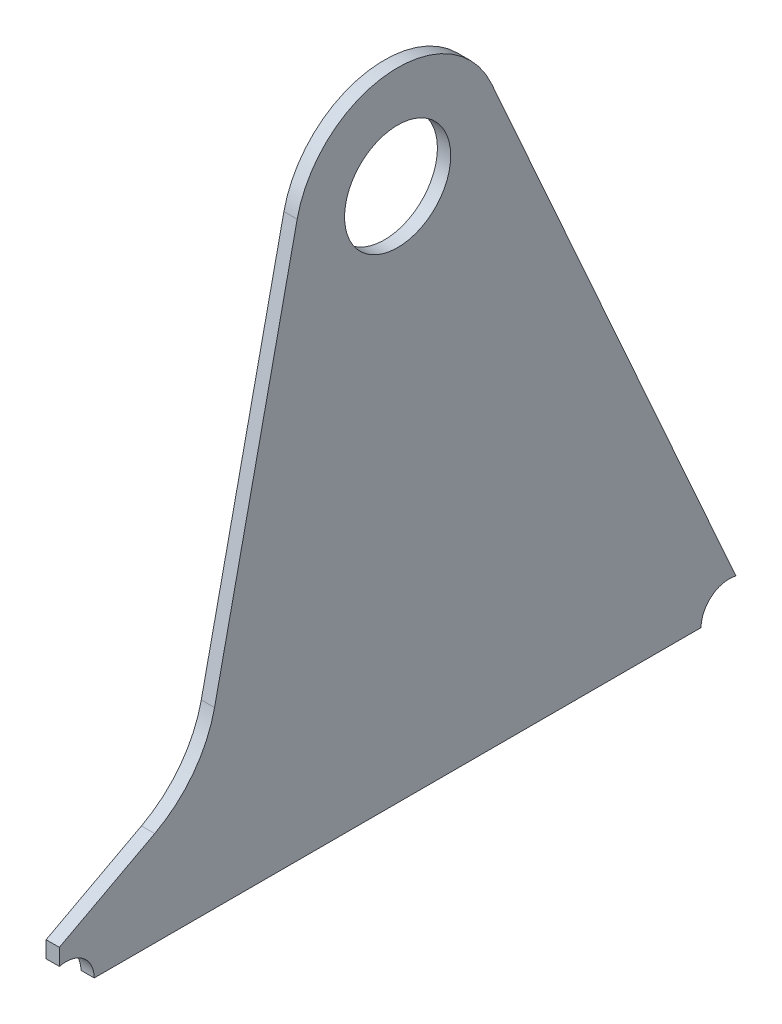
ISO-10303-21;
HEADER;
FILE_DESCRIPTION(('STEP AP214'),'2;1');
FILE_NAME('part.step','',(''),(''),'','','');
FILE_SCHEMA(('AUTOMOTIVE_DESIGN { 1 0 10303 214 1 1 1 1 }'));
ENDSEC;
DATA;
#1=APPLICATION_CONTEXT('core data for automotive mechanical design processes');
#2=APPLICATION_PROTOCOL_DEFINITION('international standard','automotive_design',2000,#1);
#3=PRODUCT_CONTEXT('',#1,'mechanical');
#4=PRODUCT('Part','Part','',(#3));
#5=PRODUCT_RELATED_PRODUCT_CATEGORY('part','',(#4));
#6=PRODUCT_DEFINITION_FORMATION('','',#4);
#7=PRODUCT_DEFINITION_CONTEXT('part definition',#1,'design');
#8=PRODUCT_DEFINITION('design','',#6,#7);
#9=PRODUCT_DEFINITION_SHAPE('','',#8);
#10=(LENGTH_UNIT() NAMED_UNIT(*) SI_UNIT(.MILLI.,.METRE.));
#11=(NAMED_UNIT(*) PLANE_ANGLE_UNIT() SI_UNIT($,.RADIAN.));
#12=(NAMED_UNIT(*) SI_UNIT($,.STERADIAN.) SOLID_ANGLE_UNIT());
#13=UNCERTAINTY_MEASURE_WITH_UNIT(LENGTH_MEASURE(1.E-05),#10,'distance_accuracy_value','');
#14=(GEOMETRIC_REPRESENTATION_CONTEXT(3) GLOBAL_UNCERTAINTY_ASSIGNED_CONTEXT((#13)) GLOBAL_UNIT_ASSIGNED_CONTEXT((#10,
#11,#12)) REPRESENTATION_CONTEXT('',''));
#15=CARTESIAN_POINT('',(0.,0.,0.));
#16=DIRECTION('',(0.,0.,1.));
#17=DIRECTION('',(1.,0.,0.));
#18=AXIS2_PLACEMENT_3D('',#15,#16,#17);
#19=CARTESIAN_POINT('',(-2.,0.,0.));
#20=DIRECTION('',(1.,0.,0.));
#21=DIRECTION('',(0.,0.,-1.));
#22=AXIS2_PLACEMENT_3D('',#19,#20,#21);
#23=CYLINDRICAL_SURFACE('',#22,31.);
#24=DIRECTION('',(1.,0.,0.));
#25=VECTOR('',#24,1.);
#26=CARTESIAN_POINT('',(-2.,6.55896973025909,30.2981833791656));
#27=LINE('',#26,#25);
#28=CARTESIAN_POINT('',(-2.,6.55896973025909,30.2981833791656));
#29=VERTEX_POINT('',#28);
#30=CARTESIAN_POINT('',(2.,6.55896973025909,30.2981833791656));
#31=VERTEX_POINT('',#30);
#32=EDGE_CURVE('E37',#29,#31,#27,.T.);
#33=ORIENTED_EDGE('',*,*,#32,.T.);
#34=CARTESIAN_POINT('',(2.,0.,0.));
#35=DIRECTION('',(1.,0.,0.));
#36=DIRECTION('',(0.,0.,1.));
#37=AXIS2_PLACEMENT_3D('',#34,#35,#36);
#38=CIRCLE('',#37,31.);
#39=CARTESIAN_POINT('',(2.,12.6177889557744,-28.3159213494376));
#40=VERTEX_POINT('',#39);
#41=EDGE_CURVE('E104',#40,#31,#38,.T.);
#42=ORIENTED_EDGE('',*,*,#41,.F.);
#43=DIRECTION('',(1.,0.,0.));
#44=VECTOR('',#43,1.);
#45=CARTESIAN_POINT('',(-2.,12.6177889557744,-28.3159213494376));
#46=LINE('',#45,#44);
#47=CARTESIAN_POINT('',(-2.,12.6177889557744,-28.3159213494376));
#48=VERTEX_POINT('',#47);
#49=EDGE_CURVE('E11',#48,#40,#46,.T.);
#50=ORIENTED_EDGE('',*,*,#49,.F.);
#51=CARTESIAN_POINT('',(-2.,0.,0.));
#52=DIRECTION('',(1.,0.,0.));
#53=DIRECTION('',(0.,0.,1.));
#54=AXIS2_PLACEMENT_3D('',#51,#52,#53);
#55=CIRCLE('',#54,31.);
#56=EDGE_CURVE('E105',#48,#29,#55,.T.);
#57=ORIENTED_EDGE('',*,*,#56,.T.);
#58=EDGE_LOOP('',(#33,#42,#50,#57));
#59=FACE_BOUND('',#58,.T.);
#60=ADVANCED_FACE('F34',(#59),#23,.T.);
#61=CARTESIAN_POINT('',(-2.,-152.738644179071,-102.));
#62=DIRECTION('',(0.,0.407025450186271,-0.913416817723794));
#63=DIRECTION('',(0.,0.913416817723794,0.407025450186271));
#64=AXIS2_PLACEMENT_3D('',#61,#62,#63);
#65=PLANE('',#64);
#66=ORIENTED_EDGE('',*,*,#49,.T.);
#67=DIRECTION('',(0.,0.913416817723794,0.407025450186271));
#68=VECTOR('',#67,1.);
#69=CARTESIAN_POINT('',(2.,-152.738644179071,-102.));
#70=LINE('',#69,#68);
#71=CARTESIAN_POINT('',(2.,-152.738644179071,-102.));
#72=VERTEX_POINT('',#71);
#73=EDGE_CURVE('E123',#72,#40,#70,.T.);
#74=ORIENTED_EDGE('',*,*,#73,.F.);
#75=DIRECTION('',(1.,0.,0.));
#76=VECTOR('',#75,1.);
#77=CARTESIAN_POINT('',(-2.,-152.738644179071,-102.));
#78=LINE('',#77,#76);
#79=CARTESIAN_POINT('',(-2.,-152.738644179071,-102.));
#80=VERTEX_POINT('',#79);
#81=EDGE_CURVE('E42',#80,#72,#78,.T.);
#82=ORIENTED_EDGE('',*,*,#81,.F.);
#83=DIRECTION('',(0.,0.913416817723794,0.407025450186271));
#84=VECTOR('',#83,1.);
#85=CARTESIAN_POINT('',(-2.,-152.738644179071,-102.));
#86=LINE('',#85,#84);
#87=EDGE_CURVE('E110',#80,#48,#86,.T.);
#88=ORIENTED_EDGE('',*,*,#87,.T.);
#89=EDGE_LOOP('',(#66,#74,#82,#88));
#90=FACE_BOUND('',#89,.T.);
#91=ADVANCED_FACE('F205',(#90),#65,.T.);
#92=CARTESIAN_POINT('',(-2.,-161.,-100.));
#93=DIRECTION('',(1.,0.,0.));
#94=DIRECTION('',(0.,0.,-1.));
#95=AXIS2_PLACEMENT_3D('',#92,#93,#94);
#96=CYLINDRICAL_SURFACE('',#95,8.5);
#97=ORIENTED_EDGE('',*,*,#81,.T.);
#98=CARTESIAN_POINT('',(2.,-161.,-100.));
#99=DIRECTION('',(-1.,0.,0.));
#100=DIRECTION('',(0.,0.,1.));
#101=AXIS2_PLACEMENT_3D('',#98,#99,#100);
#102=CIRCLE('',#101,8.5);
#103=CARTESIAN_POINT('',(2.,-161.,-91.5));
#104=VERTEX_POINT('',#103);
#105=EDGE_CURVE('E142',#104,#72,#102,.T.);
#106=ORIENTED_EDGE('',*,*,#105,.F.);
#107=DIRECTION('',(1.,0.,0.));
#108=VECTOR('',#107,1.);
#109=CARTESIAN_POINT('',(-2.,-161.,-91.5));
#110=LINE('',#109,#108);
#111=CARTESIAN_POINT('',(-2.,-161.,-91.5));
#112=VERTEX_POINT('',#111);
#113=EDGE_CURVE('E170',#112,#104,#110,.T.);
#114=ORIENTED_EDGE('',*,*,#113,.F.);
#115=CARTESIAN_POINT('',(-2.,-161.,-100.));
#116=DIRECTION('',(-1.,0.,0.));
#117=DIRECTION('',(0.,0.,1.));
#118=AXIS2_PLACEMENT_3D('',#115,#116,#117);
#119=CIRCLE('',#118,8.5);
#120=EDGE_CURVE('E166',#112,#80,#119,.T.);
#121=ORIENTED_EDGE('',*,*,#120,.T.);
#122=EDGE_LOOP('',(#97,#106,#114,#121));
#123=FACE_BOUND('',#122,.T.);
#124=ADVANCED_FACE('F203',(#123),#96,.F.);
#125=CARTESIAN_POINT('',(-2.,-161.,91.5));
#126=DIRECTION('',(0.,-1.,0.));
#127=DIRECTION('',(0.,0.,-1.));
#128=AXIS2_PLACEMENT_3D('',#125,#126,#127);
#129=PLANE('',#128);
#130=ORIENTED_EDGE('',*,*,#113,.T.);
#131=DIRECTION('',(0.,0.,-1.));
#132=VECTOR('',#131,1.);
#133=CARTESIAN_POINT('',(2.,-161.,91.5));
#134=LINE('',#133,#132);
#135=CARTESIAN_POINT('',(2.,-161.,91.5));
#136=VERTEX_POINT('',#135);
#137=EDGE_CURVE('E139',#136,#104,#134,.T.);
#138=ORIENTED_EDGE('',*,*,#137,.F.);
#139=DIRECTION('',(1.,0.,0.));
#140=VECTOR('',#139,1.);
#141=CARTESIAN_POINT('',(-2.,-161.,91.5));
#142=LINE('',#141,#140);
#143=CARTESIAN_POINT('',(-2.,-161.,91.5));
#144=VERTEX_POINT('',#143);
#145=EDGE_CURVE('E172',#144,#136,#142,.T.);
#146=ORIENTED_EDGE('',*,*,#145,.F.);
#147=DIRECTION('',(0.,0.,-1.));
#148=VECTOR('',#147,1.);
#149=CARTESIAN_POINT('',(-2.,-161.,91.5));
#150=LINE('',#149,#148);
#151=EDGE_CURVE('E163',#144,#112,#150,.T.);
#152=ORIENTED_EDGE('',*,*,#151,.T.);
#153=EDGE_LOOP('',(#130,#138,#146,#152));
#154=FACE_BOUND('',#153,.T.);
#155=ADVANCED_FACE('F201',(#154),#129,.T.);
#156=CARTESIAN_POINT('',(-2.,-161.,100.));
#157=DIRECTION('',(1.,0.,0.));
#158=DIRECTION('',(0.,0.,-1.));
#159=AXIS2_PLACEMENT_3D('',#156,#157,#158);
#160=CYLINDRICAL_SURFACE('',#159,8.5);
#161=ORIENTED_EDGE('',*,*,#145,.T.);
#162=CARTESIAN_POINT('',(2.,-161.,100.));
#163=DIRECTION('',(-1.,0.,0.));
#164=DIRECTION('',(0.,0.,-1.));
#165=AXIS2_PLACEMENT_3D('',#162,#163,#164);
#166=CIRCLE('',#165,8.5);
#167=CARTESIAN_POINT('',(2.,-152.738644179071,102.));
#168=VERTEX_POINT('',#167);
#169=EDGE_CURVE('E136',#168,#136,#166,.T.);
#170=ORIENTED_EDGE('',*,*,#169,.F.);
#171=DIRECTION('',(1.,0.,0.));
#172=VECTOR('',#171,1.);
#173=CARTESIAN_POINT('',(-2.,-152.738644179071,102.));
#174=LINE('',#173,#172);
#175=CARTESIAN_POINT('',(-2.,-152.738644179071,102.));
#176=VERTEX_POINT('',#175);
#177=EDGE_CURVE('E174',#176,#168,#174,.T.);
#178=ORIENTED_EDGE('',*,*,#177,.F.);
#179=CARTESIAN_POINT('',(-2.,-161.,100.));
#180=DIRECTION('',(-1.,0.,0.));
#181=DIRECTION('',(0.,0.,-1.));
#182=AXIS2_PLACEMENT_3D('',#179,#180,#181);
#183=CIRCLE('',#182,8.5);
#184=EDGE_CURVE('E160',#176,#144,#183,.T.);
#185=ORIENTED_EDGE('',*,*,#184,.T.);
#186=EDGE_LOOP('',(#161,#170,#178,#185));
#187=FACE_BOUND('',#186,.T.);
#188=ADVANCED_FACE('F196',(#187),#160,.F.);
#189=CARTESIAN_POINT('',(-2.,-147.738644179071,102.));
#190=DIRECTION('',(0.,0.,1.));
#191=DIRECTION('',(1.,0.,0.));
#192=AXIS2_PLACEMENT_3D('',#189,#190,#191);
#193=PLANE('',#192);
#194=ORIENTED_EDGE('',*,*,#177,.T.);
#195=DIRECTION('',(0.,-1.,0.));
#196=VECTOR('',#195,1.);
#197=CARTESIAN_POINT('',(2.,-147.738644179071,102.));
#198=LINE('',#197,#196);
#199=CARTESIAN_POINT('',(2.,-147.738644179071,102.));
#200=VERTEX_POINT('',#199);
#201=EDGE_CURVE('E133',#200,#168,#198,.T.);
#202=ORIENTED_EDGE('',*,*,#201,.F.);
#203=DIRECTION('',(1.,0.,0.));
#204=VECTOR('',#203,1.);
#205=CARTESIAN_POINT('',(-2.,-147.738644179071,102.));
#206=LINE('',#205,#204);
#207=CARTESIAN_POINT('',(-2.,-147.738644179071,102.));
#208=VERTEX_POINT('',#207);
#209=EDGE_CURVE('E176',#208,#200,#206,.T.);
#210=ORIENTED_EDGE('',*,*,#209,.F.);
#211=DIRECTION('',(0.,-1.,0.));
#212=VECTOR('',#211,1.);
#213=CARTESIAN_POINT('',(-2.,-147.738644179071,102.));
#214=LINE('',#213,#212);
#215=EDGE_CURVE('E157',#208,#176,#214,.T.);
#216=ORIENTED_EDGE('',*,*,#215,.T.);
#217=EDGE_LOOP('',(#194,#202,#210,#216));
#218=FACE_BOUND('',#217,.T.);
#219=ADVANCED_FACE('F189',(#218),#193,.T.);
#220=CARTESIAN_POINT('',(-2.,-132.405518824536,73.2503899602474));
#221=DIRECTION('',(0.,0.88235294117647,0.470588235294118));
#222=DIRECTION('',(0.,-0.470588235294118,0.88235294117647));
#223=AXIS2_PLACEMENT_3D('',#220,#221,#222);
#224=PLANE('',#223);
#225=ORIENTED_EDGE('',*,*,#209,.T.);
#226=DIRECTION('',(0.,-0.470588235294118,0.88235294117647));
#227=VECTOR('',#226,1.);
#228=CARTESIAN_POINT('',(2.,-132.405518824536,73.2503899602474));
#229=LINE('',#228,#227);
#230=CARTESIAN_POINT('',(2.,-132.405518824537,73.2503899602472));
#231=VERTEX_POINT('',#230);
#232=EDGE_CURVE('E130',#231,#200,#229,.T.);
#233=ORIENTED_EDGE('',*,*,#232,.F.);
#234=DIRECTION('',(1.,0.,0.));
#235=VECTOR('',#234,1.);
#236=CARTESIAN_POINT('',(-2.,-132.405518824537,73.2503899602472));
#237=LINE('',#236,#235);
#238=CARTESIAN_POINT('',(-2.,-132.405518824537,73.2503899602472));
#239=VERTEX_POINT('',#238);
#240=EDGE_CURVE('E178',#239,#231,#237,.T.);
#241=ORIENTED_EDGE('',*,*,#240,.F.);
#242=DIRECTION('',(0.,-0.470588235294118,0.88235294117647));
#243=VECTOR('',#242,1.);
#244=CARTESIAN_POINT('',(-2.,-132.405518824536,73.2503899602474));
#245=LINE('',#244,#243);
#246=EDGE_CURVE('E154',#239,#208,#245,.T.);
#247=ORIENTED_EDGE('',*,*,#246,.T.);
#248=EDGE_LOOP('',(#225,#233,#241,#247));
#249=FACE_BOUND('',#248,.T.);
#250=ADVANCED_FACE('F186',(#249),#224,.T.);
#251=CARTESIAN_POINT('',(-2.,-101.,90.));
#252=DIRECTION('',(1.,0.,0.));
#253=DIRECTION('',(0.,0.,-1.));
#254=AXIS2_PLACEMENT_3D('',#251,#252,#253);
#255=CYLINDRICAL_SURFACE('',#254,35.5929213344748);
#256=ORIENTED_EDGE('',*,*,#240,.T.);
#257=CARTESIAN_POINT('',(2.,-101.,90.));
#258=DIRECTION('',(-1.,0.,0.));
#259=DIRECTION('',(0.,0.,1.));
#260=AXIS2_PLACEMENT_3D('',#257,#258,#259);
#261=CIRCLE('',#260,35.5929213344748);
#262=CARTESIAN_POINT('',(2.,-108.530738504654,55.2128755615433));
#263=VERTEX_POINT('',#262);
#264=EDGE_CURVE('E117',#263,#231,#261,.T.);
#265=ORIENTED_EDGE('',*,*,#264,.F.);
#266=DIRECTION('',(1.,0.,0.));
#267=VECTOR('',#266,1.);
#268=CARTESIAN_POINT('',(-2.,-108.530738504654,55.2128755615433));
#269=LINE('',#268,#267);
#270=CARTESIAN_POINT('',(-2.,-108.530738504654,55.2128755615433));
#271=VERTEX_POINT('',#270);
#272=EDGE_CURVE('E109',#271,#263,#269,.T.);
#273=ORIENTED_EDGE('',*,*,#272,.F.);
#274=CARTESIAN_POINT('',(-2.,-101.,90.));
#275=DIRECTION('',(-1.,0.,0.));
#276=DIRECTION('',(0.,0.,1.));
#277=AXIS2_PLACEMENT_3D('',#274,#275,#276);
#278=CIRCLE('',#277,35.5929213344748);
#279=EDGE_CURVE('E151',#271,#239,#278,.T.);
#280=ORIENTED_EDGE('',*,*,#279,.T.);
#281=EDGE_LOOP('',(#256,#265,#273,#280));
#282=FACE_BOUND('',#281,.T.);
#283=ADVANCED_FACE('F180',(#282),#255,.F.);
#284=CARTESIAN_POINT('',(-2.,6.55896973025909,30.2981833791656));
#285=DIRECTION('',(0.,0.211579668718035,0.977360754166631));
#286=DIRECTION('',(0.,-0.977360754166631,0.211579668718035));
#287=AXIS2_PLACEMENT_3D('',#284,#285,#286);
#288=PLANE('',#287);
#289=ORIENTED_EDGE('',*,*,#272,.T.);
#290=DIRECTION('',(0.,-0.977360754166631,0.211579668718035));
#291=VECTOR('',#290,1.);
#292=CARTESIAN_POINT('',(2.,6.55896973025909,30.2981833791656));
#293=LINE('',#292,#291);
#294=EDGE_CURVE('E112',#31,#263,#293,.T.);
#295=ORIENTED_EDGE('',*,*,#294,.F.);
#296=ORIENTED_EDGE('',*,*,#32,.F.);
#297=DIRECTION('',(0.,-0.977360754166631,0.211579668718035));
#298=VECTOR('',#297,1.);
#299=CARTESIAN_POINT('',(-2.,6.55896973025909,30.2981833791656));
#300=LINE('',#299,#298);
#301=EDGE_CURVE('E149',#29,#271,#300,.T.);
#302=ORIENTED_EDGE('',*,*,#301,.T.);
#303=EDGE_LOOP('',(#289,#295,#296,#302));
#304=FACE_BOUND('',#303,.T.);
#305=ADVANCED_FACE('F113',(#304),#288,.T.);
#306=CARTESIAN_POINT('',(-2.,0.,0.));
#307=DIRECTION('',(-1.,0.,0.));
#308=DIRECTION('',(0.,0.,1.));
#309=AXIS2_PLACEMENT_3D('',#306,#307,#308);
#310=PLANE('',#309);
#311=CARTESIAN_POINT('',(-2.,0.,0.));
#312=DIRECTION('',(1.,0.,0.));
#313=DIRECTION('',(0.,0.,-1.));
#314=AXIS2_PLACEMENT_3D('',#311,#312,#313);
#315=CIRCLE('',#314,16.);
#316=CARTESIAN_POINT('',(-2.,0.,-16.));
#317=VERTEX_POINT('',#316);
#318=EDGE_CURVE('E145',#317,#317,#315,.T.);
#319=ORIENTED_EDGE('',*,*,#318,.T.);
#320=EDGE_LOOP('',(#319));
#321=FACE_BOUND('',#320,.T.);
#322=ORIENTED_EDGE('',*,*,#56,.F.);
#323=ORIENTED_EDGE('',*,*,#87,.F.);
#324=ORIENTED_EDGE('',*,*,#120,.F.);
#325=ORIENTED_EDGE('',*,*,#151,.F.);
#326=ORIENTED_EDGE('',*,*,#184,.F.);
#327=ORIENTED_EDGE('',*,*,#215,.F.);
#328=ORIENTED_EDGE('',*,*,#246,.F.);
#329=ORIENTED_EDGE('',*,*,#279,.F.);
#330=ORIENTED_EDGE('',*,*,#301,.F.);
#331=EDGE_LOOP('',(#322,#323,#324,#325,#326,#327,#328,#329,#330));
#332=FACE_BOUND('',#331,.T.);
#333=ADVANCED_FACE('F192',(#321,#332),#310,.T.);
#334=CARTESIAN_POINT('',(-2.,0.,0.));
#335=DIRECTION('',(1.,0.,0.));
#336=DIRECTION('',(0.,0.,-1.));
#337=AXIS2_PLACEMENT_3D('',#334,#335,#336);
#338=CYLINDRICAL_SURFACE('',#337,16.);
#339=ORIENTED_EDGE('',*,*,#318,.F.);
#340=EDGE_LOOP('',(#339));
#341=FACE_BOUND('',#340,.T.);
#342=CARTESIAN_POINT('',(2.,0.,0.));
#343=DIRECTION('',(1.,0.,0.));
#344=DIRECTION('',(0.,0.,-1.));
#345=AXIS2_PLACEMENT_3D('',#342,#343,#344);
#346=CIRCLE('',#345,16.);
#347=CARTESIAN_POINT('',(2.,0.,-16.));
#348=VERTEX_POINT('',#347);
#349=EDGE_CURVE('E124',#348,#348,#346,.T.);
#350=ORIENTED_EDGE('',*,*,#349,.T.);
#351=EDGE_LOOP('',(#350));
#352=FACE_BOUND('',#351,.T.);
#353=ADVANCED_FACE('F229',(#341,#352),#338,.F.);
#354=CARTESIAN_POINT('',(2.,0.,0.));
#355=DIRECTION('',(-1.,0.,0.));
#356=DIRECTION('',(0.,0.,1.));
#357=AXIS2_PLACEMENT_3D('',#354,#355,#356);
#358=PLANE('',#357);
#359=ORIENTED_EDGE('',*,*,#41,.T.);
#360=ORIENTED_EDGE('',*,*,#294,.T.);
#361=ORIENTED_EDGE('',*,*,#264,.T.);
#362=ORIENTED_EDGE('',*,*,#232,.T.);
#363=ORIENTED_EDGE('',*,*,#201,.T.);
#364=ORIENTED_EDGE('',*,*,#169,.T.);
#365=ORIENTED_EDGE('',*,*,#137,.T.);
#366=ORIENTED_EDGE('',*,*,#105,.T.);
#367=ORIENTED_EDGE('',*,*,#73,.T.);
#368=EDGE_LOOP('',(#359,#360,#361,#362,#363,#364,#365,#366,#367));
#369=FACE_BOUND('',#368,.T.);
#370=ORIENTED_EDGE('',*,*,#349,.F.);
#371=EDGE_LOOP('',(#370));
#372=FACE_BOUND('',#371,.T.);
#373=ADVANCED_FACE('F120',(#369,#372),#358,.F.);
#374=CLOSED_SHELL('',(#60,#91,#124,#155,#188,#219,#250,#283,#305,#333,#353,#373));
#375=MANIFOLD_SOLID_BREP('B2',#374);
#376=ADVANCED_BREP_SHAPE_REPRESENTATION('',(#18,#375),#14);
#377=SHAPE_DEFINITION_REPRESENTATION(#9,#376);
ENDSEC;
END-ISO-10303-21;
